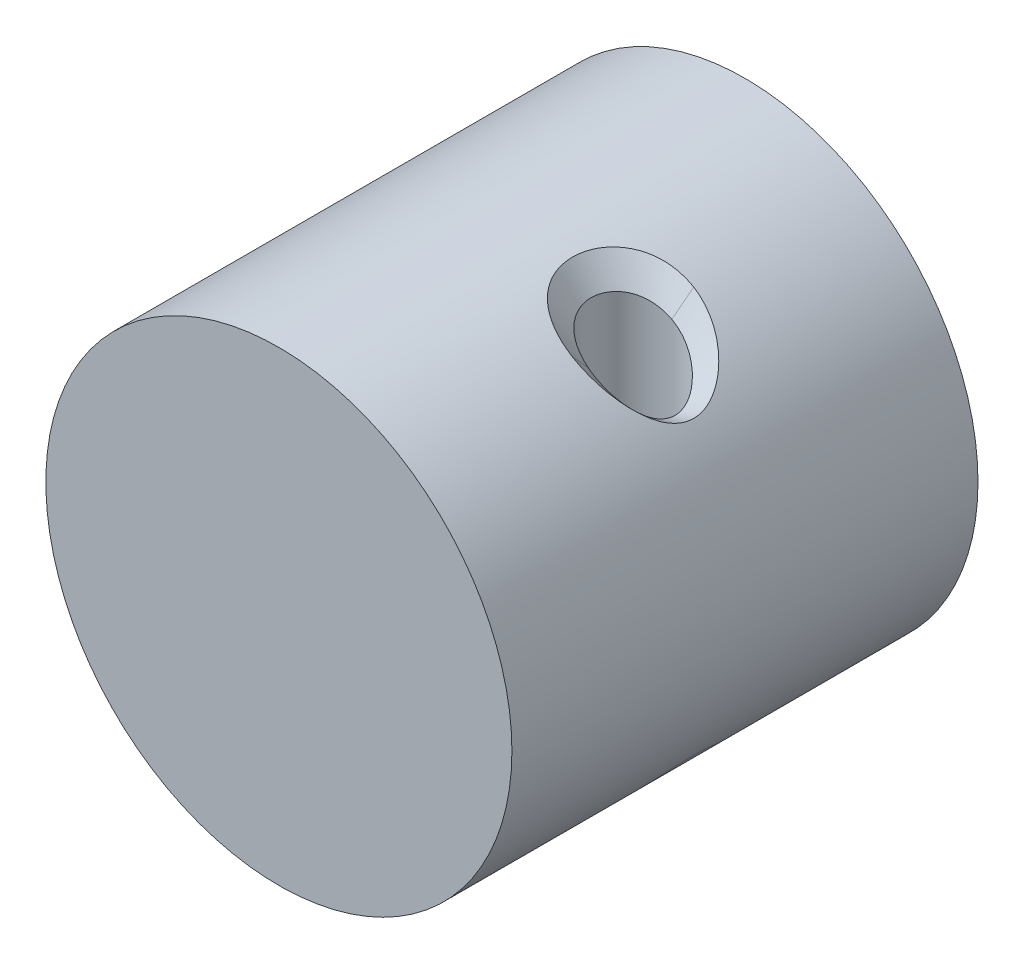
ISO-10303-21;
HEADER;
FILE_DESCRIPTION(('STEP AP214'),'2;1');
FILE_NAME('part.step','',(''),(''),'','','');
FILE_SCHEMA(('AUTOMOTIVE_DESIGN { 1 0 10303 214 1 1 1 1 }'));
ENDSEC;
DATA;
#1=APPLICATION_CONTEXT('core data for automotive mechanical design processes');
#2=APPLICATION_PROTOCOL_DEFINITION('international standard','automotive_design',2000,#1);
#3=PRODUCT_CONTEXT('',#1,'mechanical');
#4=PRODUCT('Part','Part','',(#3));
#5=PRODUCT_RELATED_PRODUCT_CATEGORY('part','',(#4));
#6=PRODUCT_DEFINITION_FORMATION('','',#4);
#7=PRODUCT_DEFINITION_CONTEXT('part definition',#1,'design');
#8=PRODUCT_DEFINITION('design','',#6,#7);
#9=PRODUCT_DEFINITION_SHAPE('','',#8);
#10=(LENGTH_UNIT() NAMED_UNIT(*) SI_UNIT(.MILLI.,.METRE.));
#11=(NAMED_UNIT(*) PLANE_ANGLE_UNIT() SI_UNIT($,.RADIAN.));
#12=(NAMED_UNIT(*) SI_UNIT($,.STERADIAN.) SOLID_ANGLE_UNIT());
#13=UNCERTAINTY_MEASURE_WITH_UNIT(LENGTH_MEASURE(1.E-05),#10,'distance_accuracy_value','');
#14=(GEOMETRIC_REPRESENTATION_CONTEXT(3) GLOBAL_UNCERTAINTY_ASSIGNED_CONTEXT((#13)) GLOBAL_UNIT_ASSIGNED_CONTEXT((#10,
#11,#12)) REPRESENTATION_CONTEXT('',''));
#15=CARTESIAN_POINT('',(0.,0.,0.));
#16=DIRECTION('',(0.,0.,1.));
#17=DIRECTION('',(1.,0.,0.));
#18=AXIS2_PLACEMENT_3D('',#15,#16,#17);
#19=CARTESIAN_POINT('',(13.,0.,0.));
#20=DIRECTION('',(0.,1.,0.));
#21=DIRECTION('',(0.,0.,1.));
#22=AXIS2_PLACEMENT_3D('',#19,#20,#21);
#23=PLANE('',#22);
#24=CARTESIAN_POINT('',(13.,0.,0.));
#25=DIRECTION('',(0.,1.,0.));
#26=DIRECTION('',(0.,0.,1.));
#27=AXIS2_PLACEMENT_3D('',#24,#25,#26);
#28=CIRCLE('',#27,4.5);
#29=CARTESIAN_POINT('',(13.,0.,4.5));
#30=VERTEX_POINT('',#29);
#31=EDGE_CURVE('E98',#30,#30,#28,.T.);
#32=ORIENTED_EDGE('',*,*,#31,.T.);
#33=EDGE_LOOP('',(#32));
#34=FACE_BOUND('',#33,.T.);
#35=ADVANCED_FACE('F52',(#34),#23,.T.);
#36=CARTESIAN_POINT('',(13.,50.,0.));
#37=DIRECTION('',(0.,-1.,0.));
#38=DIRECTION('',(0.,0.,-1.));
#39=AXIS2_PLACEMENT_3D('',#36,#37,#38);
#40=CYLINDRICAL_SURFACE('',#39,4.5);
#41=CARTESIAN_POINT('',(12.6674084370145,19.1973113609655,-4.48769237495518));
#42=CARTESIAN_POINT('',(12.8113358238304,19.1023404059298,-4.49835911200799));
#43=CARTESIAN_POINT('',(13.0991839004251,18.9072580588767,-4.5063241617474));
#44=CARTESIAN_POINT('',(13.6617635169946,18.5064168589458,-4.46930170712324));
#45=CARTESIAN_POINT('',(14.3381963674568,17.9894192372052,-4.32706851873552));
#46=CARTESIAN_POINT('',(15.0946728075174,17.3601425977765,-4.01362366231027));
#47=CARTESIAN_POINT('',(15.5995863116715,16.904254576384,-3.68627302350128));
#48=CARTESIAN_POINT('',(15.8562052480272,16.6608534851448,-3.47778969389754));
#49=CARTESIAN_POINT('',(16.0669317363568,16.4593012614342,-3.30043980984165));
#50=CARTESIAN_POINT('',(16.4309151331398,16.0993014532313,-2.94728824067339));
#51=CARTESIAN_POINT('',(16.7941973879742,15.7167870314836,-2.44692623098707));
#52=CARTESIAN_POINT('',(16.983813185499,15.5097994722607,-2.09470855603637));
#53=CARTESIAN_POINT('',(17.123160758998,15.3563859996964,-1.81591534970741));
#54=CARTESIAN_POINT('',(17.3307933039793,15.1232501912469,-1.30815995468614));
#55=CARTESIAN_POINT('',(17.477223749417,14.9519703822807,-0.613966273751012));
#56=CARTESIAN_POINT('',(17.4999849645947,14.9248291862753,-0.135857605967893));
#57=CARTESIAN_POINT('',(17.500022976544,14.9247846155879,0.206981820881932));
#58=CARTESIAN_POINT('',(17.4592368779605,14.9733619495722,0.756746770999842));
#59=CARTESIAN_POINT('',(17.2816077531659,15.1791715803523,1.44235796175824));
#60=CARTESIAN_POINT('',(17.0922270972506,15.3904574173731,1.87806944195416));
#61=CARTESIAN_POINT('',(16.9537228780467,15.5429112009438,2.15463406285004));
#62=CARTESIAN_POINT('',(16.7280344588034,15.7879222581436,2.55257721334004));
#63=CARTESIAN_POINT('',(16.3498136758131,16.1809825839583,3.03152755758218));
#64=CARTESIAN_POINT('',(16.0225696392356,16.5017467246879,3.33783889660257));
#65=CARTESIAN_POINT('',(15.8107191359716,16.7043491546741,3.51602766735527));
#66=CARTESIAN_POINT('',(15.5042812879849,16.9924013923794,3.75548494706409));
#67=CARTESIAN_POINT('',(14.9374670457241,17.4952333437093,4.09264580900104));
#68=CARTESIAN_POINT('',(14.1677401278714,18.124167034424,4.3761622224166));
#69=CARTESIAN_POINT('',(13.5126011806002,18.6153944955988,4.48654029876084));
#70=CARTESIAN_POINT('',(13.0071784220408,18.9699333893024,4.50463425543822));
#71=CARTESIAN_POINT('',(12.7799605964352,19.1230511116192,4.49605678743081));
#72=CARTESIAN_POINT('',(12.6665018748657,19.1979095282279,4.48762509580868));
#73=B_SPLINE_CURVE_WITH_KNOTS('',3,(#41,#42,#43,#44,#45,#46,#47,#48,#49,#50,#51,#52,#53,#54,#55,
#56,#57,#58,#59,#60,#61,#62,#63,#64,#65,#66,#67,#68,#69,#70,#71,#72),.UNSPECIFIED.,.F.,.F.,(4,1,
1,1,1,1,2,1,1,2,1,1,2,1,1,2,1,1,2,1,1,1,1,1,4),(0.,0.0296896401485679,0.0598626461155993,
0.119408406822819,0.178730743103001,0.238354257784476,0.25,0.297615050684946,0.357302345031847,
0.375,0.416881684684477,0.476580961989798,0.5,0.535897216868327,0.595460837860267,0.625,
0.655103409158899,0.71480391039653,0.75,0.773993967575648,0.833502102369901,0.892973295664285,
0.952561608972212,0.976448157278832,1.),.UNSPECIFIED.);
#74=CARTESIAN_POINT('',(12.6665018748657,19.1979095282279,4.48762509580868));
#75=VERTEX_POINT('',#74);
#76=CARTESIAN_POINT('',(12.6674084370145,19.1973113609655,-4.48769237495518));
#77=VERTEX_POINT('',#76);
#78=EDGE_CURVE('E83',#75,#77,#73,.F.);
#79=ORIENTED_EDGE('',*,*,#78,.T.);
#80=CARTESIAN_POINT('',(12.6665018748657,19.1979095282279,4.48762509580868));
#81=CARTESIAN_POINT('',(12.6131981718189,19.2330785373112,4.48366382795558));
#82=CARTESIAN_POINT('',(12.2962525293367,19.4400311675716,4.45414106820997));
#83=CARTESIAN_POINT('',(11.7100548373801,19.800423296512,4.33460743339638));
#84=CARTESIAN_POINT('',(10.929297934166,20.240439546616,4.02196270607052));
#85=CARTESIAN_POINT('',(10.2987709254565,20.5676177196548,3.62127118908255));
#86=CARTESIAN_POINT('',(9.94643954261468,20.7385496692951,3.31012668310573));
#87=CARTESIAN_POINT('',(9.73522102177483,20.8382957152601,3.09936476327365));
#88=CARTESIAN_POINT('',(9.44992829491727,20.971039185884,2.78853867659577));
#89=CARTESIAN_POINT('',(9.03379254638274,21.154996277946,2.17737056260884));
#90=CARTESIAN_POINT('',(8.66861197126774,21.306412533022,1.31304371530424));
#91=CARTESIAN_POINT('',(8.52036292590334,21.3640299297582,0.571486881982933));
#92=CARTESIAN_POINT('',(8.5002096437545,21.3716268931547,0.131182841398295));
#93=CARTESIAN_POINT('',(8.49968931844248,21.3718338381658,-0.185222961185701));
#94=CARTESIAN_POINT('',(8.5337917163399,21.3590359432492,-0.693415329155401));
#95=CARTESIAN_POINT('',(8.72856440729164,21.282297227023,-1.49352296497387));
#96=CARTESIAN_POINT('',(9.12647163947304,21.1151698407143,-2.33999326248839));
#97=CARTESIAN_POINT('',(9.5259431771974,20.9361898019072,-2.87841901789714));
#98=CARTESIAN_POINT('',(9.77214658269875,20.8208360763074,-3.13597650500143));
#99=CARTESIAN_POINT('',(9.98300709592635,20.7213611393454,-3.34747287516098));
#100=CARTESIAN_POINT('',(10.3874404596494,20.5236094464724,-3.69066277642946));
#101=CARTESIAN_POINT('',(11.0821410400566,20.15718564984,-4.09639697845266));
#102=CARTESIAN_POINT('',(11.7371438829625,19.7818319359338,-4.33173357381014));
#103=CARTESIAN_POINT('',(12.2693063408019,19.4555121724186,-4.44578865224781));
#104=CARTESIAN_POINT('',(12.5345292085128,19.2849921527481,-4.47784443828681));
#105=CARTESIAN_POINT('',(12.6674084370145,19.1973113609655,-4.48769237495518));
#106=B_SPLINE_CURVE_WITH_KNOTS('',3,(#80,#81,#82,#83,#84,#85,#86,#87,#88,#89,#90,#91,#92,#93,
#94,#95,#96,#97,#98,#99,#100,#101,#102,#103,#104,#105),.UNSPECIFIED.,.F.,.F.,(4,1,1,1,1,2,1,1,1,
1,2,1,1,1,1,2,1,1,1,1,4),(0.,0.0133885612293722,0.0793808651694622,0.145097142208488,
0.21099489500588,0.25,0.276916801100498,0.342555924877209,0.40842866580359,0.474326727089329,
0.5,0.539951206349501,0.605810998055243,0.671682046337782,0.737169997600315,0.75,
0.803015722914086,0.868407472297188,0.93423853821616,0.966832853205194,1.),.UNSPECIFIED.);
#107=EDGE_CURVE('E81',#77,#75,#106,.F.);
#108=ORIENTED_EDGE('',*,*,#107,.T.);
#109=EDGE_LOOP('',(#79,#108));
#110=FACE_BOUND('',#109,.T.);
#111=ORIENTED_EDGE('',*,*,#31,.F.);
#112=EDGE_LOOP('',(#111));
#113=FACE_BOUND('',#112,.T.);
#114=ADVANCED_FACE('F85',(#110,#113),#40,.F.);
#115=CARTESIAN_POINT('',(12.999002085176,21.3547639834673,6.50001883242266));
#116=CARTESIAN_POINT('',(12.6665018748657,19.1979095282279,4.48762509580868));
#117=CARTESIAN_POINT('',(12.9171721668449,21.4041696805128,6.49902418484315));
#118=CARTESIAN_POINT('',(12.6131981718189,19.2330785373112,4.48366382795558));
#119=CARTESIAN_POINT('',(12.4320020576317,21.6970963743211,6.49312691298189));
#120=CARTESIAN_POINT('',(12.2962525293367,19.4400311675716,4.45414106820997));
#121=CARTESIAN_POINT('',(11.5259498878056,22.1987006791078,6.37173345215423));
#122=CARTESIAN_POINT('',(11.7100548373801,19.800423296512,4.33460743339638));
#123=CARTESIAN_POINT('',(10.3028418143287,22.7910425642522,5.96241081864674));
#124=CARTESIAN_POINT('',(10.929297934166,20.240439546616,4.02196270607052));
#125=CARTESIAN_POINT('',(9.30461061900081,23.2102929060864,5.38424551430267));
#126=CARTESIAN_POINT('',(10.2987709254565,20.5676177196548,3.62127118908255));
#127=CARTESIAN_POINT('',(8.74822327686546,23.4203147467519,4.92382111997309));
#128=CARTESIAN_POINT('',(9.94643954261468,20.7385496692951,3.31012668310573));
#129=CARTESIAN_POINT('',(8.41583743083256,23.5413165469265,4.61188360408399));
#130=CARTESIAN_POINT('',(9.73522102177483,20.8382957152601,3.09936476327365));
#131=CARTESIAN_POINT('',(7.9658761288538,23.7005695983142,4.15201632126697));
#132=CARTESIAN_POINT('',(9.44992829491727,20.971039185884,2.78853867659577));
#133=CARTESIAN_POINT('',(7.30921595688821,23.9112641032729,3.24351165236692));
#134=CARTESIAN_POINT('',(9.03379254638274,21.154996277946,2.17737056260884));
#135=CARTESIAN_POINT('',(6.74537114955316,24.0740345154516,1.94883089304484));
#136=CARTESIAN_POINT('',(8.66861197126774,21.306412533022,1.31304371530424));
#137=CARTESIAN_POINT('',(6.52756424326578,24.1327498307024,0.837764370752551));
#138=CARTESIAN_POINT('',(8.52036292590334,21.3640299297582,0.571486881982933));
#139=CARTESIAN_POINT('',(6.4999997771481,24.1402389486494,0.182556287341253));
#140=CARTESIAN_POINT('',(8.5002096437545,21.3716268931547,0.131182841398295));
#141=CARTESIAN_POINT('',(6.50010830123597,24.1402282317526,-0.286995089134747));
#142=CARTESIAN_POINT('',(8.49968931844248,21.3718338381658,-0.185222961185701));
#143=CARTESIAN_POINT('',(6.55011993869301,24.1267176908903,-1.04407938032401));
#144=CARTESIAN_POINT('',(8.5337917163399,21.3590359432492,-0.693415329155401));
#145=CARTESIAN_POINT('',(6.84455973948589,24.0464575745716,-2.242065553867));
#146=CARTESIAN_POINT('',(8.72856440729164,21.282297227023,-1.49352296497387));
#147=CARTESIAN_POINT('',(7.4670173370514,23.8630727700917,-3.50522812547374));
#148=CARTESIAN_POINT('',(9.12647163947304,21.1151698407143,-2.33999326248839));
#149=CARTESIAN_POINT('',(8.10017976839173,23.6544606755916,-4.30084811682228));
#150=CARTESIAN_POINT('',(9.5259431771974,20.9361898019072,-2.87841901789714));
#151=CARTESIAN_POINT('',(8.48842637452462,23.5149059013199,-4.68010112659256));
#152=CARTESIAN_POINT('',(9.77214658269875,20.8208360763074,-3.13597650500143));
#153=CARTESIAN_POINT('',(8.82052377814038,23.3939562993395,-4.99149780326333));
#154=CARTESIAN_POINT('',(9.98300709592635,20.7213611393454,-3.34747287516098));
#155=CARTESIAN_POINT('',(9.45992284340521,23.1495655670542,-5.49603698984151));
#156=CARTESIAN_POINT('',(10.3874404596494,20.5236094464724,-3.69066277642946));
#157=CARTESIAN_POINT('',(10.555904086329,22.6753767552809,-6.06985924333391));
#158=CARTESIAN_POINT('',(11.0821410400566,20.15718564984,-4.09639697845266));
#159=CARTESIAN_POINT('',(11.5755396272118,22.1666440692279,-6.36429624873822));
#160=CARTESIAN_POINT('',(11.7371438829625,19.7818319359338,-4.33173357381014));
#161=CARTESIAN_POINT('',(12.3933762916966,21.7166280919984,-6.48374603856901));
#162=CARTESIAN_POINT('',(12.2693063408019,19.4555121724186,-4.44578865224781));
#163=CARTESIAN_POINT('',(12.7966212416046,21.4756799798169,-6.49455064078507));
#164=CARTESIAN_POINT('',(12.5345292085128,19.2849921527481,-4.47784443828681));
#165=CARTESIAN_POINT('',(13.,21.3541565040626,-6.5));
#166=CARTESIAN_POINT('',(12.6674084370145,19.1973113609655,-4.48769237495518));
#167=B_SPLINE_SURFACE_WITH_KNOTS('',3,1,((#115,#116),(#117,#118),(#119,#120),(#121,#122),(#123,
#124),(#125,#126),(#127,#128),(#129,#130),(#131,#132),(#133,#134),(#135,#136),(#137,#138),(#139,
#140),(#141,#142),(#143,#144),(#145,#146),(#147,#148),(#149,#150),(#151,#152),(#153,#154),(#155,
#156),(#157,#158),(#159,#160),(#161,#162),(#163,#164),(#165,#166)),.UNSPECIFIED.,.F.,.F.,.F.,(4,
1,1,1,1,2,1,1,1,1,2,1,1,1,1,2,1,1,1,1,4),(2,2),(0.,0.0133885612293722,0.0793808651694622,
0.145097142208488,0.21099489500588,0.25,0.276916801100498,0.342555924877209,0.40842866580359,
0.474326727089329,0.5,0.539951206349501,0.605810998055243,0.671682046337782,0.737169997600315,
0.75,0.803015722914086,0.868407472297188,0.93423853821616,0.966832853205194,1.),(0.,1.),.UNSPECIFIED.);
#168=CARTESIAN_POINT('',(13.,21.3541565040626,-6.5));
#169=CARTESIAN_POINT('',(12.7966212416046,21.4756799798169,-6.49455064078507));
#170=CARTESIAN_POINT('',(12.3933762916966,21.7166280919984,-6.48374603856901));
#171=CARTESIAN_POINT('',(11.5755396272118,22.1666440692279,-6.36429624873822));
#172=CARTESIAN_POINT('',(10.555904086329,22.6753767552809,-6.06985924333391));
#173=CARTESIAN_POINT('',(9.45992284340521,23.1495655670542,-5.49603698984151));
#174=CARTESIAN_POINT('',(8.82052377814038,23.3939562993395,-4.99149780326333));
#175=CARTESIAN_POINT('',(8.48842637452462,23.5149059013199,-4.68010112659256));
#176=CARTESIAN_POINT('',(8.10017976839173,23.6544606755916,-4.30084811682228));
#177=CARTESIAN_POINT('',(7.4670173370514,23.8630727700917,-3.50522812547374));
#178=CARTESIAN_POINT('',(6.84455973948589,24.0464575745716,-2.242065553867));
#179=CARTESIAN_POINT('',(6.55011993869301,24.1267176908903,-1.04407938032401));
#180=CARTESIAN_POINT('',(6.50010830123597,24.1402282317526,-0.286995089134747));
#181=CARTESIAN_POINT('',(6.4999997771481,24.1402389486494,0.182556287341253));
#182=CARTESIAN_POINT('',(6.52756424326578,24.1327498307024,0.837764370752551));
#183=CARTESIAN_POINT('',(6.74537114955316,24.0740345154516,1.94883089304484));
#184=CARTESIAN_POINT('',(7.30921595688821,23.9112641032729,3.24351165236692));
#185=CARTESIAN_POINT('',(7.9658761288538,23.7005695983142,4.15201632126697));
#186=CARTESIAN_POINT('',(8.41583743083256,23.5413165469265,4.61188360408399));
#187=CARTESIAN_POINT('',(8.74822327686546,23.4203147467519,4.92382111997309));
#188=CARTESIAN_POINT('',(9.30461061900081,23.2102929060864,5.38424551430267));
#189=CARTESIAN_POINT('',(10.3028418143287,22.7910425642522,5.96241081864674));
#190=CARTESIAN_POINT('',(11.5259498878056,22.1987006791078,6.37173345215423));
#191=CARTESIAN_POINT('',(12.4320020576317,21.6970963743211,6.49312691298189));
#192=CARTESIAN_POINT('',(12.9171721668449,21.4041696805128,6.49902418484315));
#193=CARTESIAN_POINT('',(12.999002085176,21.3547639834673,6.50001883242266));
#194=B_SPLINE_CURVE_WITH_KNOTS('',3,(#168,#169,#170,#171,#172,#173,#174,#175,#176,#177,#178,
#179,#180,#181,#182,#183,#184,#185,#186,#187,#188,#189,#190,#191,#192,#193),.UNSPECIFIED.,.F.,
.F.,(4,1,1,1,1,2,1,1,1,1,2,1,1,1,1,2,1,1,1,1,4),(0.,0.0331671467948065,0.0657614617838401,
0.131592527702812,0.196984277085914,0.25,0.262830002399685,0.328317953662218,0.394189001944757,
0.460048793650499,0.5,0.525673272910671,0.59157133419641,0.657444075122791,0.723083198899502,
0.75,0.78900510499412,0.854902857791512,0.920619134830538,0.986611438770628,1.),.UNSPECIFIED.);
#195=CARTESIAN_POINT('',(13.,21.3541565040626,-6.5));
#196=VERTEX_POINT('',#195);
#197=CARTESIAN_POINT('',(12.999002085176,21.3547639834673,6.50001883242266));
#198=VERTEX_POINT('',#197);
#199=EDGE_CURVE('E71',#196,#198,#194,.T.);
#200=DIRECTION('',(-0.112007508709105,-0.726567643232607,-0.677903959127098));
#201=VECTOR('',#200,1.);
#202=CARTESIAN_POINT('',(12.8327519800208,20.2763367558476,5.49382196411568));
#203=LINE('',#202,#201);
#204=EDGE_CURVE('E91',#198,#75,#203,.T.);
#205=DIRECTION('',(0.112040354500132,0.726577945228933,-0.677887489536712));
#206=VECTOR('',#205,1.);
#207=CARTESIAN_POINT('',(12.8337042185072,20.2757339325141,-5.49384618747759));
#208=LINE('',#207,#206);
#209=EDGE_CURVE('E92',#77,#196,#208,.T.);
#210=ORIENTED_EDGE('',*,*,#199,.T.);
#211=ORIENTED_EDGE('',*,*,#204,.T.);
#212=ORIENTED_EDGE('',*,*,#107,.F.);
#213=ORIENTED_EDGE('',*,*,#209,.T.);
#214=EDGE_LOOP('',(#210,#211,#212,#213));
#215=FACE_BOUND('',#214,.T.);
#216=ADVANCED_FACE('F96',(#215),#167,.F.);
#217=CARTESIAN_POINT('',(13.,21.3541565040626,-6.5));
#218=CARTESIAN_POINT('',(12.6674084370145,19.1973113609655,-4.48769237495518));
#219=CARTESIAN_POINT('',(13.1992790013318,21.2305933588053,-6.49465375152879));
#220=CARTESIAN_POINT('',(12.8113358238304,19.1023404059298,-4.49835911200799));
#221=CARTESIAN_POINT('',(13.6010813901552,20.9814553833885,-6.48387421433412));
#222=CARTESIAN_POINT('',(13.0991839004251,18.9072580588767,-4.5063241617474));
#223=CARTESIAN_POINT('',(14.3796155177113,20.4593525698118,-6.37149499309609));
#224=CARTESIAN_POINT('',(13.6617635169946,18.5064168589458,-4.46930170712324));
#225=CARTESIAN_POINT('',(15.3097802638075,19.7795511977209,-6.11196278116478));
#226=CARTESIAN_POINT('',(14.3381963674568,17.9894192372052,-4.32706851873552));
#227=CARTESIAN_POINT('',(16.3345700156585,18.9402665889614,-5.61749651581658));
#228=CARTESIAN_POINT('',(15.0946728075174,17.3601425977765,-4.01362366231027));
#229=CARTESIAN_POINT('',(17.0107158271626,18.3256995584929,-5.13264296648664));
#230=CARTESIAN_POINT('',(15.5995863116715,16.904254576384,-3.68627302350128));
#231=CARTESIAN_POINT('',(17.3523956256727,17.9972272775758,-4.828299974974));
#232=CARTESIAN_POINT('',(15.8562052480272,16.6608534851448,-3.47778969389754));
#233=CARTESIAN_POINT('',(17.6326695117756,17.7253141227659,-4.56979707030042));
#234=CARTESIAN_POINT('',(16.0669317363568,16.4593012614342,-3.30043980984165));
#235=CARTESIAN_POINT('',(18.1117660548251,17.2419495095163,-4.06145781800549));
#236=CARTESIAN_POINT('',(16.4309151331398,16.0993014532313,-2.94728824067339));
#237=CARTESIAN_POINT('',(18.5856061148733,16.7241260731791,-3.36032049766761));
#238=CARTESIAN_POINT('',(16.7941973879742,15.7167870314836,-2.44692623098707));
#239=CARTESIAN_POINT('',(18.8313698454318,16.4434010347376,-2.87425670746));
#240=CARTESIAN_POINT('',(16.983813185499,15.5097994722607,-2.09470855603637));
#241=CARTESIAN_POINT('',(19.01126133873,16.2359827890433,-2.49096236630277));
#242=CARTESIAN_POINT('',(17.123160758998,15.3563859996964,-1.81591534970741));
#243=CARTESIAN_POINT('',(19.2803496335029,15.9175020223257,-1.80086273891094));
#244=CARTESIAN_POINT('',(17.3307933039793,15.1232501912469,-1.30815995468614));
#245=CARTESIAN_POINT('',(19.4722231939147,15.6789280181968,-0.844922754333107));
#246=CARTESIAN_POINT('',(17.477223749417,14.9519703822807,-0.613966273751012));
#247=CARTESIAN_POINT('',(19.4996547352324,15.6450599487486,-0.18547678789009));
#248=CARTESIAN_POINT('',(17.4999849645947,14.9248291862753,-0.135857605967893));
#249=CARTESIAN_POINT('',(19.4994000653617,15.6454645978393,0.285264124330699));
#250=CARTESIAN_POINT('',(17.500022976544,14.9247846155879,0.206981820881932));
#251=CARTESIAN_POINT('',(19.4500705059274,15.7067365992941,1.04318894027679));
#252=CARTESIAN_POINT('',(17.4592368779605,14.9733619495722,0.756746770999842));
#253=CARTESIAN_POINT('',(19.2191758370433,15.991296590182,1.9756067310797));
#254=CARTESIAN_POINT('',(17.2816077531659,15.1791715803523,1.44235796175824));
#255=CARTESIAN_POINT('',(18.9735748602009,16.2794520310086,2.57134110419737));
#256=CARTESIAN_POINT('',(17.0922270972506,15.3904574173731,1.87806944195416));
#257=CARTESIAN_POINT('',(18.7935507709909,16.4869726036245,2.95490645656287));
#258=CARTESIAN_POINT('',(16.9537228780467,15.5429112009438,2.15463406285004));
#259=CARTESIAN_POINT('',(18.4985097865872,16.8218988477916,3.50911708822982));
#260=CARTESIAN_POINT('',(16.7280344588034,15.7879222581436,2.55257721334004));
#261=CARTESIAN_POINT('',(18.0035350212498,17.3534817322114,4.18428263933512));
#262=CARTESIAN_POINT('',(16.3498136758131,16.1809825839583,3.03152755758218));
#263=CARTESIAN_POINT('',(17.5733062426627,17.7829167536281,4.62458553839832));
#264=CARTESIAN_POINT('',(16.0225696392356,16.5017467246879,3.33783889660257));
#265=CARTESIAN_POINT('',(17.2933639921247,18.0544791646627,4.88275905719596));
#266=CARTESIAN_POINT('',(15.8107191359716,16.7043491546741,3.51602766735527));
#267=CARTESIAN_POINT('',(16.8872856742177,18.4411526091785,5.23114831744185));
#268=CARTESIAN_POINT('',(15.5042812879849,16.9924013923794,3.75548494706409));
#269=CARTESIAN_POINT('',(16.1294667610176,19.1155920627508,5.73436558583765));
#270=CARTESIAN_POINT('',(14.9374670457241,17.4952333437093,4.09264580900104));
#271=CARTESIAN_POINT('',(15.0847915161424,19.9519410243129,6.19263095188708));
#272=CARTESIAN_POINT('',(14.1677401278714,18.124167034424,4.3761622224166));
#273=CARTESIAN_POINT('',(14.1794602441239,20.5977016845316,6.409700228549));
#274=CARTESIAN_POINT('',(13.5126011806002,18.6153944955988,4.48654029876084));
#275=CARTESIAN_POINT('',(13.4759561627709,21.0601738337326,6.48993849056815));
#276=CARTESIAN_POINT('',(13.0071784220408,18.9699333893024,4.50463425543822));
#277=CARTESIAN_POINT('',(13.1572371948174,21.2570302459183,6.49667456077577));
#278=CARTESIAN_POINT('',(12.7799605964352,19.1230511116192,4.49605678743081));
#279=CARTESIAN_POINT('',(12.999002085176,21.3547639834673,6.50001883242267));
#280=CARTESIAN_POINT('',(12.6665018748657,19.1979095282279,4.48762509580868));
#281=B_SPLINE_SURFACE_WITH_KNOTS('',3,1,((#217,#218),(#219,#220),(#221,#222),(#223,#224),(#225,
#226),(#227,#228),(#229,#230),(#231,#232),(#233,#234),(#235,#236),(#237,#238),(#239,#240),(#241,
#242),(#243,#244),(#245,#246),(#247,#248),(#249,#250),(#251,#252),(#253,#254),(#255,#256),(#257,
#258),(#259,#260),(#261,#262),(#263,#264),(#265,#266),(#267,#268),(#269,#270),(#271,#272),(#273,
#274),(#275,#276),(#277,#278),(#279,#280)),.UNSPECIFIED.,.F.,.F.,.F.,(4,1,1,1,1,1,2,1,1,2,1,1,2,
1,1,2,1,1,2,1,1,1,1,1,4),(2,2),(0.,0.0296896401485679,0.0598626461155993,0.119408406822819,
0.178730743103001,0.238354257784476,0.25,0.297615050684946,0.357302345031847,0.375,
0.416881684684477,0.476580961989798,0.5,0.535897216868327,0.595460837860267,0.625,
0.655103409158899,0.71480391039653,0.75,0.773993967575648,0.833502102369901,0.892973295664285,
0.952561608972212,0.976448157278832,1.),(0.,1.),.UNSPECIFIED.);
#282=CARTESIAN_POINT('',(12.999002085176,21.3547639834673,6.50001883242267));
#283=CARTESIAN_POINT('',(13.1572371948174,21.2570302459183,6.49667456077577));
#284=CARTESIAN_POINT('',(13.4759561627709,21.0601738337326,6.48993849056815));
#285=CARTESIAN_POINT('',(14.1794602441239,20.5977016845316,6.409700228549));
#286=CARTESIAN_POINT('',(15.0847915161424,19.9519410243129,6.19263095188708));
#287=CARTESIAN_POINT('',(16.1294667610176,19.1155920627508,5.73436558583765));
#288=CARTESIAN_POINT('',(16.8872856742177,18.4411526091785,5.23114831744185));
#289=CARTESIAN_POINT('',(17.2933639921247,18.0544791646627,4.88275905719596));
#290=CARTESIAN_POINT('',(17.5733062426627,17.7829167536281,4.62458553839832));
#291=CARTESIAN_POINT('',(18.0035350212498,17.3534817322114,4.18428263933512));
#292=CARTESIAN_POINT('',(18.4985097865872,16.8218988477916,3.50911708822982));
#293=CARTESIAN_POINT('',(18.7935507709909,16.4869726036245,2.95490645656287));
#294=CARTESIAN_POINT('',(18.9735748602009,16.2794520310086,2.57134110419737));
#295=CARTESIAN_POINT('',(19.2191758370433,15.991296590182,1.9756067310797));
#296=CARTESIAN_POINT('',(19.4500705059274,15.7067365992941,1.04318894027679));
#297=CARTESIAN_POINT('',(19.4994000653617,15.6454645978393,0.285264124330699));
#298=CARTESIAN_POINT('',(19.4996547352324,15.6450599487486,-0.18547678789009));
#299=CARTESIAN_POINT('',(19.4722231939147,15.6789280181968,-0.844922754333107));
#300=CARTESIAN_POINT('',(19.2803496335029,15.9175020223257,-1.80086273891094));
#301=CARTESIAN_POINT('',(19.01126133873,16.2359827890433,-2.49096236630277));
#302=CARTESIAN_POINT('',(18.8313698454318,16.4434010347376,-2.87425670746));
#303=CARTESIAN_POINT('',(18.5856061148733,16.7241260731791,-3.36032049766761));
#304=CARTESIAN_POINT('',(18.1117660548251,17.2419495095163,-4.06145781800549));
#305=CARTESIAN_POINT('',(17.6326695117756,17.7253141227659,-4.56979707030042));
#306=CARTESIAN_POINT('',(17.3523956256727,17.9972272775758,-4.828299974974));
#307=CARTESIAN_POINT('',(17.0107158271626,18.3256995584929,-5.13264296648664));
#308=CARTESIAN_POINT('',(16.3345700156585,18.9402665889614,-5.61749651581658));
#309=CARTESIAN_POINT('',(15.3097802638075,19.7795511977209,-6.11196278116478));
#310=CARTESIAN_POINT('',(14.3796155177113,20.4593525698118,-6.37149499309609));
#311=CARTESIAN_POINT('',(13.6010813901552,20.9814553833885,-6.48387421433412));
#312=CARTESIAN_POINT('',(13.1992790013318,21.2305933588053,-6.49465375152879));
#313=CARTESIAN_POINT('',(13.,21.3541565040626,-6.5));
#314=B_SPLINE_CURVE_WITH_KNOTS('',3,(#282,#283,#284,#285,#286,#287,#288,#289,#290,#291,#292,
#293,#294,#295,#296,#297,#298,#299,#300,#301,#302,#303,#304,#305,#306,#307,#308,#309,#310,#311,
#312,#313),.UNSPECIFIED.,.F.,.F.,(4,1,1,1,1,1,2,1,1,2,1,1,2,1,1,2,1,1,2,1,1,1,1,1,4),(0.,
0.0235518427211676,0.0474383910277878,0.107026704335715,0.166497897630099,0.226006032424352,
0.25,0.28519608960347,0.344896590841101,0.375,0.404539162139733,0.464102783131673,0.5,
0.523419038010202,0.583118315315523,0.625,0.642697654968153,0.702384949315054,0.75,
0.761645742215524,0.821269256896999,0.880591593177181,0.940137353884401,0.970310359851432,1.),.UNSPECIFIED.);
#315=EDGE_CURVE('E62',#198,#196,#314,.T.);
#316=ORIENTED_EDGE('',*,*,#315,.T.);
#317=ORIENTED_EDGE('',*,*,#209,.F.);
#318=ORIENTED_EDGE('',*,*,#78,.F.);
#319=ORIENTED_EDGE('',*,*,#204,.F.);
#320=EDGE_LOOP('',(#316,#317,#318,#319));
#321=FACE_BOUND('',#320,.T.);
#322=ADVANCED_FACE('F100',(#321),#281,.F.);
#323=CARTESIAN_POINT('',(0.,0.,25.));
#324=DIRECTION('',(0.,0.,-1.));
#325=DIRECTION('',(-1.,0.,0.));
#326=AXIS2_PLACEMENT_3D('',#323,#324,#325);
#327=CYLINDRICAL_SURFACE('',#326,25.);
#328=CARTESIAN_POINT('',(13.,-21.3541565040626,-6.5));
#329=CARTESIAN_POINT('',(13.0991065003664,-21.2938243507708,-6.5000040935284));
#330=CARTESIAN_POINT('',(13.1977879029238,-21.232801484001,-6.49774828449632));
#331=CARTESIAN_POINT('',(13.3948042121914,-21.1090695763485,-6.4887878503398));
#332=CARTESIAN_POINT('',(13.4931324243456,-21.0463520070919,-6.48205367003937));
#333=CARTESIAN_POINT('',(13.6894089106053,-20.9192225458876,-6.46413798506059));
#334=CARTESIAN_POINT('',(13.7873477267121,-20.8548010692973,-6.45292105488845));
#335=CARTESIAN_POINT('',(13.9828157841583,-20.7242563966996,-6.42604637812811));
#336=CARTESIAN_POINT('',(14.0803325300578,-20.6581228986514,-6.4103478948509));
#337=CARTESIAN_POINT('',(14.2715112498532,-20.526497563586,-6.37514530761036));
#338=CARTESIAN_POINT('',(14.3652090162786,-20.461030022854,-6.35574442676144));
#339=CARTESIAN_POINT('',(14.551515542733,-20.3289569965468,-6.31288037065299));
#340=CARTESIAN_POINT('',(14.6441174760614,-20.2623477077814,-6.28939925005405));
#341=CARTESIAN_POINT('',(14.8282224943009,-20.1280122447243,-6.2383791431412));
#342=CARTESIAN_POINT('',(14.9197163100986,-20.0602818688121,-6.21081779510063));
#343=CARTESIAN_POINT('',(15.1015960152262,-19.9237250198674,-6.15164084651389));
#344=CARTESIAN_POINT('',(15.1919700378876,-19.8548942177731,-6.11999879210978));
#345=CARTESIAN_POINT('',(15.3706446672693,-19.7168960182733,-6.05302659468933));
#346=CARTESIAN_POINT('',(15.4589503197845,-19.6477300794814,-6.01770690030551));
#347=CARTESIAN_POINT('',(15.6337052509512,-19.5089650001979,-5.94333072716571));
#348=CARTESIAN_POINT('',(15.7201535924676,-19.4393656628584,-5.90427241384483));
#349=CARTESIAN_POINT('',(15.8912100650798,-19.2997836275117,-5.82242254818172));
#350=CARTESIAN_POINT('',(15.9758150264575,-19.2298004939928,-5.77962511570326));
#351=CARTESIAN_POINT('',(16.1432018520203,-19.0894995368113,-5.69030050166403));
#352=CARTESIAN_POINT('',(16.2259781743109,-19.0191813197147,-5.64376355753604));
#353=CARTESIAN_POINT('',(16.3892527845837,-18.8786643915012,-5.54724709204718));
#354=CARTESIAN_POINT('',(16.4697553451635,-18.8084657266493,-5.49727473089063));
#355=CARTESIAN_POINT('',(16.6281441087102,-18.6685812763863,-5.39407930458088));
#356=CARTESIAN_POINT('',(16.7060421617426,-18.5988947782616,-5.34087540090002));
#357=CARTESIAN_POINT('',(16.859268864816,-18.4601108195034,-5.23122028616534));
#358=CARTESIAN_POINT('',(16.9346072247664,-18.3910121152647,-5.1747842214447));
#359=CARTESIAN_POINT('',(17.0827617820378,-18.253477319784,-5.05866849557164));
#360=CARTESIAN_POINT('',(17.1555853550356,-18.1850398076024,-4.99899992678556));
#361=CARTESIAN_POINT('',(17.3011940141336,-18.0465812611234,-4.87434258463741));
#362=CARTESIAN_POINT('',(17.3739039997388,-17.9765792166833,-4.80924489163312));
#363=CARTESIAN_POINT('',(17.5158042404787,-17.8383375163651,-4.67627966868507));
#364=CARTESIAN_POINT('',(17.5850281182669,-17.7700867858919,-4.60845957270159));
#365=CARTESIAN_POINT('',(17.7200401311087,-17.6354517246345,-4.47005312898225));
#366=CARTESIAN_POINT('',(17.7858593775535,-17.5690548447909,-4.39950937436849));
#367=CARTESIAN_POINT('',(17.9141447980695,-17.4382258663769,-4.25566129873148));
#368=CARTESIAN_POINT('',(17.9766391991059,-17.3737803788327,-4.1823943399573));
#369=CARTESIAN_POINT('',(18.1016531242031,-17.2435106507837,-4.02906367174767));
#370=CARTESIAN_POINT('',(18.1640494647202,-17.1777531045091,-3.94884256728187));
#371=CARTESIAN_POINT('',(18.2844139878511,-17.0495680794234,-3.78626304279279));
#372=CARTESIAN_POINT('',(18.3424479370877,-16.9870995776631,-3.70398578090694));
#373=CARTESIAN_POINT('',(18.4542054922338,-16.8656152189975,-3.53729979902593));
#374=CARTESIAN_POINT('',(18.5079914520935,-16.8065556067307,-3.45296490047472));
#375=CARTESIAN_POINT('',(18.611365871886,-16.692001283834,-3.2821729991658));
#376=CARTESIAN_POINT('',(18.6610124101968,-16.6364615720959,-3.19578140490315));
#377=CARTESIAN_POINT('',(18.7605728356983,-16.5241323061377,-3.01287753883694));
#378=CARTESIAN_POINT('',(18.8102295102664,-16.4675594545479,-2.91609138433404));
#379=CARTESIAN_POINT('',(18.9040800590985,-16.359728850743,-2.72103696062071));
#380=CARTESIAN_POINT('',(18.9483853075677,-16.3083687688283,-2.62287945467567));
#381=CARTESIAN_POINT('',(19.0112212858223,-16.2349769994937,-2.4736691035687));
#382=CARTESIAN_POINT('',(19.0313862823124,-16.2113310811309,-2.42408798651378));
#383=CARTESIAN_POINT('',(19.0704156500786,-16.1653996005963,-2.3245753700951));
#384=CARTESIAN_POINT('',(19.0892923550478,-16.1431014792402,-2.27465453463875));
#385=CARTESIAN_POINT('',(19.125759546754,-16.0998792798656,-2.17446512919143));
#386=CARTESIAN_POINT('',(19.1433616720897,-16.0789430146264,-2.12420605533899));
#387=CARTESIAN_POINT('',(19.1772947946242,-16.0384555105974,-2.02334152440601));
#388=CARTESIAN_POINT('',(19.1936366255801,-16.0188926385473,-1.97274438578671));
#389=CARTESIAN_POINT('',(19.2264902933574,-15.9794487491287,-1.8665869948892));
#390=CARTESIAN_POINT('',(19.2429072828575,-15.9596719242976,-1.81095853361683));
#391=CARTESIAN_POINT('',(19.2741656176606,-15.9219073226147,-1.69953198621939));
#392=CARTESIAN_POINT('',(19.2890248333965,-15.9038994512007,-1.6437457352059));
#393=CARTESIAN_POINT('',(19.3171844566309,-15.8696839841654,-1.53200557699238));
#394=CARTESIAN_POINT('',(19.3305013735071,-15.8534574427745,-1.47606164413039));
#395=CARTESIAN_POINT('',(19.3555913455747,-15.8228149101037,-1.36400800139044));
#396=CARTESIAN_POINT('',(19.3673793545534,-15.8083814512323,-1.30790642616224));
#397=CARTESIAN_POINT('',(19.3894253234541,-15.781333507529,-1.19553936917749));
#398=CARTESIAN_POINT('',(19.3996964800884,-15.7687033702014,-1.13928025182577));
#399=CARTESIAN_POINT('',(19.4187212281245,-15.7452688745599,-1.02659991800875));
#400=CARTESIAN_POINT('',(19.4274860692241,-15.7344509984854,-0.970183417562132));
#401=CARTESIAN_POINT('',(19.4435092669872,-15.7146463109409,-0.85718989385211));
#402=CARTESIAN_POINT('',(19.4507767536253,-15.7056484089079,-0.800616112944049));
#403=CARTESIAN_POINT('',(19.4638152590642,-15.6894870182233,-0.687309775937096));
#404=CARTESIAN_POINT('',(19.4695931377633,-15.6823151224738,-0.63057920953388));
#405=CARTESIAN_POINT('',(19.4798292877223,-15.6695985796659,-0.515048005225102));
#406=CARTESIAN_POINT('',(19.4842418469246,-15.6641103454464,-0.456237078040793));
#407=CARTESIAN_POINT('',(19.4914561224778,-15.6551324263412,-0.338629312124846));
#408=CARTESIAN_POINT('',(19.4942649474095,-15.6516339222147,-0.279833584302175));
#409=CARTESIAN_POINT('',(19.4982780755746,-15.6466342183815,-0.162257218428014));
#410=CARTESIAN_POINT('',(19.4994865738611,-15.6451277966978,-0.103476946374102));
#411=CARTESIAN_POINT('',(19.5003033131918,-15.6441097901422,0.0140678017225282));
#412=CARTESIAN_POINT('',(19.4999127581822,-15.6445967044637,0.0728322563471731));
#413=CARTESIAN_POINT('',(19.4975339886353,-15.6475612145597,0.190345096351634));
#414=CARTESIAN_POINT('',(19.4955439643463,-15.6500410652818,0.249093388079914));
#415=CARTESIAN_POINT('',(19.489966971859,-15.6569858942201,0.366574052478343));
#416=CARTESIAN_POINT('',(19.4863752154034,-15.6614568245635,0.425305845086545));
#417=CARTESIAN_POINT('',(19.4775937256667,-15.6723767161954,0.542754054326496));
#418=CARTESIAN_POINT('',(19.4723963171036,-15.6788351776252,0.601469011277569));
#419=CARTESIAN_POINT('',(19.4604000901418,-15.6937223195722,0.718884572283594));
#420=CARTESIAN_POINT('',(19.4535908482479,-15.7021638213094,0.777582482312803));
#421=CARTESIAN_POINT('',(19.4387487050476,-15.7205337766771,0.892024240420271));
#422=CARTESIAN_POINT('',(19.4307790907762,-15.7303850320303,0.947788745834417));
#423=CARTESIAN_POINT('',(19.4133989016206,-15.7518295676765,1.05913094307115));
#424=CARTESIAN_POINT('',(19.4039795006243,-15.7634335094229,1.11470520182193));
#425=CARTESIAN_POINT('',(19.3836920218405,-15.7883736952342,1.22566778557481));
#426=CARTESIAN_POINT('',(19.3728131798879,-15.8017227900362,1.28105124872122));
#427=CARTESIAN_POINT('',(19.3495979264051,-15.8301421272012,1.39163380033815));
#428=CARTESIAN_POINT('',(19.3372489729047,-15.8452271365823,1.44682645395248));
#429=CARTESIAN_POINT('',(19.3110829462021,-15.8771063197699,1.55702895278396));
#430=CARTESIAN_POINT('',(19.2972517242551,-15.8939168860574,1.61203068768387));
#431=CARTESIAN_POINT('',(19.2681090449585,-15.9292342591532,1.72185302216611));
#432=CARTESIAN_POINT('',(19.2527820116623,-15.9477587803465,1.77666378093739));
#433=CARTESIAN_POINT('',(19.2206341598655,-15.9864900474641,1.88610594532809));
#434=CARTESIAN_POINT('',(19.2037965212149,-16.0067155220316,1.94072576920809));
#435=CARTESIAN_POINT('',(19.1686119047227,-16.0488342585664,2.04978756439596));
#436=CARTESIAN_POINT('',(19.1502470341843,-16.0707469712874,2.1042162377976));
#437=CARTESIAN_POINT('',(19.1137771119511,-16.1141013514713,2.20782867766221));
#438=CARTESIAN_POINT('',(19.095766046868,-16.1354435907254,2.25708723299172));
#439=CARTESIAN_POINT('',(19.0585407796501,-16.1793961996477,2.35523999757607));
#440=CARTESIAN_POINT('',(19.0393162770684,-16.2020171864199,2.40412552460753));
#441=CARTESIAN_POINT('',(18.9794786869268,-16.272160450661,2.55106608159923));
#442=CARTESIAN_POINT('',(18.9372897540544,-16.321262023936,2.64773581962479));
#443=CARTESIAN_POINT('',(18.8479738102763,-16.4243309642296,2.83966319500754));
#444=CARTESIAN_POINT('',(18.8007506644211,-16.4783884774235,2.93482718531156));
#445=CARTESIAN_POINT('',(18.7012368676351,-16.5912491839388,3.12376754634547));
#446=CARTESIAN_POINT('',(18.6488436522038,-16.6501412241674,3.2174366414946));
#447=CARTESIAN_POINT('',(18.5440981135333,-16.7666975300941,3.39453023173741));
#448=CARTESIAN_POINT('',(18.4919831425386,-16.8241750089325,3.47821897800196));
#449=CARTESIAN_POINT('',(18.3838407736005,-16.942281901195,3.64348106873198));
#450=CARTESIAN_POINT('',(18.3277619391019,-17.002948278974,3.72499429654385));
#451=CARTESIAN_POINT('',(18.2115926202413,-17.1273252456489,3.88591133027562));
#452=CARTESIAN_POINT('',(18.1514468746285,-17.1910714873569,3.96524757874433));
#453=CARTESIAN_POINT('',(18.0270386262241,-17.3214941956204,4.12181870782451));
#454=CARTESIAN_POINT('',(17.9627177422471,-17.3882037911851,4.19897950390819));
#455=CARTESIAN_POINT('',(17.8337178305758,-17.5204657984332,4.34677174649007));
#456=CARTESIAN_POINT('',(17.769142919421,-17.5859676197654,4.41753956969859));
#457=CARTESIAN_POINT('',(17.6368454301535,-17.7186494963302,4.5562775939128));
#458=CARTESIAN_POINT('',(17.5690992005019,-17.7858394852017,4.62421573376878));
#459=CARTESIAN_POINT('',(17.4303884482309,-17.9218048695971,4.75729902018917));
#460=CARTESIAN_POINT('',(17.3593975313286,-17.9905895110177,4.82240718239913));
#461=CARTESIAN_POINT('',(17.2141252800649,-18.1296475004482,4.9498362568212));
#462=CARTESIAN_POINT('',(17.1398151355552,-18.1999288481291,5.01211556553101));
#463=CARTESIAN_POINT('',(16.9906144025534,-18.3392800324123,5.13165697895062));
#464=CARTESIAN_POINT('',(16.9157808176815,-18.4083383221724,5.1890037554277));
#465=CARTESIAN_POINT('',(16.7637287452745,-18.5469134783164,5.3003652256482));
#466=CARTESIAN_POINT('',(16.686505759135,-18.6164309880687,5.35437297776272));
#467=CARTESIAN_POINT('',(16.5296379981321,-18.7558554552938,5.45906077145419));
#468=CARTESIAN_POINT('',(16.449986403559,-18.8257629507748,5.50972987564494));
#469=CARTESIAN_POINT('',(16.2882246820332,-18.965896646476,5.60774497319198));
#470=CARTESIAN_POINT('',(16.2061055934466,-19.036122945915,5.65507602998505));
#471=CARTESIAN_POINT('',(16.039554796154,-19.1766679251833,5.74631539049775));
#472=CARTESIAN_POINT('',(15.9551167446954,-19.2469862235569,5.79021270540357));
#473=CARTESIAN_POINT('',(15.7845350847303,-19.3871243771985,5.87417404687402));
#474=CARTESIAN_POINT('',(15.6983987384024,-19.4569451154319,5.91425134669196));
#475=CARTESIAN_POINT('',(15.5244135406138,-19.5960444432206,5.99057697336758));
#476=CARTESIAN_POINT('',(15.4365695412697,-19.6653239546776,6.02683467715943));
#477=CARTESIAN_POINT('',(15.2591627413563,-19.8032967415042,6.09552564311886));
#478=CARTESIAN_POINT('',(15.1696025198647,-19.8719907019327,6.12796418954187));
#479=CARTESIAN_POINT('',(14.9883958039257,-20.0090215380179,6.18913977180566));
#480=CARTESIAN_POINT('',(14.8967428037997,-20.0773561444027,6.21786263320769));
#481=CARTESIAN_POINT('',(14.7124353048331,-20.2127986387994,6.2711381417338));
#482=CARTESIAN_POINT('',(14.6197931664683,-20.2799118561066,6.29571996498964));
#483=CARTESIAN_POINT('',(14.4335260291856,-20.4128964056463,6.34071807036186));
#484=CARTESIAN_POINT('',(14.3399107291985,-20.4787728661606,6.3611593135748));
#485=CARTESIAN_POINT('',(14.1517162556176,-20.6092690936565,6.3978807148512));
#486=CARTESIAN_POINT('',(14.0571442885569,-20.6738935118588,6.41418126460088));
#487=CARTESIAN_POINT('',(13.8640993997077,-20.8038614979891,6.44306685964727));
#488=CARTESIAN_POINT('',(13.7655903809664,-20.86917672328,6.45553863247237));
#489=CARTESIAN_POINT('',(13.5682779342504,-20.9979899377333,6.47589873524698));
#490=CARTESIAN_POINT('',(13.4694863988198,-21.0614993497199,6.48382989224761));
#491=CARTESIAN_POINT('',(13.2716488606228,-21.186715831284,6.49511441101006));
#492=CARTESIAN_POINT('',(13.1726116644614,-21.2484334408636,6.49850496022547));
#493=CARTESIAN_POINT('',(12.9743225107114,-21.3700817124107,6.50071403124447));
#494=CARTESIAN_POINT('',(12.8750766161125,-21.4300216858091,6.49956355303124));
#495=CARTESIAN_POINT('',(12.6731018378515,-21.5500968348348,6.49258272796512));
#496=CARTESIAN_POINT('',(12.5703529340449,-21.6101909502852,6.48662293063964));
#497=CARTESIAN_POINT('',(12.3653798983774,-21.7281203875587,6.4697925683611));
#498=CARTESIAN_POINT('',(12.2631613042797,-21.7859726265988,6.45897335006627));
#499=CARTESIAN_POINT('',(12.0593051486032,-21.8994669005764,6.43243186006068));
#500=CARTESIAN_POINT('',(11.95767021184,-21.9551237276718,6.41675281998188));
#501=CARTESIAN_POINT('',(11.755036181896,-22.0642760423038,6.38049975563496));
#502=CARTESIAN_POINT('',(11.6540375268462,-22.1177837688602,6.35996016378475));
#503=CARTESIAN_POINT('',(11.4494224891062,-22.2244099651021,6.31324245588116));
#504=CARTESIAN_POINT('',(11.3458110670883,-22.2774766229339,6.28692394810724));
#505=CARTESIAN_POINT('',(11.1400820269258,-22.381056862113,6.22917286445328));
#506=CARTESIAN_POINT('',(11.0379597056877,-22.4315903255331,6.19779277960888));
#507=CARTESIAN_POINT('',(10.8352747785067,-22.5301891538966,6.12992915367913));
#508=CARTESIAN_POINT('',(10.7347062173684,-22.5782704929876,6.09348665714014));
#509=CARTESIAN_POINT('',(10.5351913445643,-22.6720494844534,6.01550959008162));
#510=CARTESIAN_POINT('',(10.4362391622175,-22.7177587586297,5.97400402767985));
#511=CARTESIAN_POINT('',(10.2383717333512,-22.8076239019278,5.88517947096459));
#512=CARTESIAN_POINT('',(10.1394749573654,-22.8517505335412,5.8377896674718));
#513=CARTESIAN_POINT('',(9.94423827116651,-22.937379876445,5.73802667763033));
#514=CARTESIAN_POINT('',(9.84788407497903,-22.9789010749722,5.68569735425013));
#515=CARTESIAN_POINT('',(9.65779709834008,-23.0594351494103,5.57606850537195));
#516=CARTESIAN_POINT('',(9.56405252713316,-23.0984609460047,5.51879893437591));
#517=CARTESIAN_POINT('',(9.37924440874577,-23.1741173405463,5.39930334121794));
#518=CARTESIAN_POINT('',(9.28817342641992,-23.210755014068,5.33709329733105));
#519=CARTESIAN_POINT('',(9.10677503005434,-23.2825334860131,5.20630261726791));
#520=CARTESIAN_POINT('',(9.01650633249682,-23.3176247494467,5.1376132710101));
#521=CARTESIAN_POINT('',(8.83972400438916,-23.3852128356188,4.99557680884273));
#522=CARTESIAN_POINT('',(8.75319020099424,-23.4177246917592,4.92226197175953));
#523=CARTESIAN_POINT('',(8.58393404862168,-23.4802936336258,4.77098919765835));
#524=CARTESIAN_POINT('',(8.50119949169134,-23.5103588627013,4.69304829373565));
#525=CARTESIAN_POINT('',(8.33959115205998,-23.5681688382914,4.53253874340159));
#526=CARTESIAN_POINT('',(8.2607152770359,-23.5959148482903,4.4499726582297));
#527=CARTESIAN_POINT('',(8.10685304889565,-23.6492193681154,4.28021979055678));
#528=CARTESIAN_POINT('',(8.03187692111647,-23.6747722311316,4.193021963945));
#529=CARTESIAN_POINT('',(7.88672001695132,-23.7235217427209,4.01479415254687));
#530=CARTESIAN_POINT('',(7.81651861332789,-23.7467287693409,3.92378381613496));
#531=CARTESIAN_POINT('',(7.68094998491988,-23.7909243811581,3.7379448680722));
#532=CARTESIAN_POINT('',(7.6155752034759,-23.8119164572372,3.64312260015386));
#533=CARTESIAN_POINT('',(7.48969132192663,-23.8518110849123,3.44967329981906));
#534=CARTESIAN_POINT('',(7.42918954470628,-23.8707105071836,3.35104085904285));
#535=CARTESIAN_POINT('',(7.31285117514979,-23.9066087523924,3.14960172300746));
#536=CARTESIAN_POINT('',(7.25705763025853,-23.9235904364953,3.04676710542406));
#537=CARTESIAN_POINT('',(7.15119249684183,-23.9554480699489,2.83835602950552));
#538=CARTESIAN_POINT('',(7.10110076669739,-23.9703314789139,2.73279094876385));
#539=CARTESIAN_POINT('',(7.00665857034019,-23.9981073792378,2.51893026611341));
#540=CARTESIAN_POINT('',(6.96230529694831,-24.0110008446515,2.410636030487));
#541=CARTESIAN_POINT('',(6.87935200308109,-24.0348993260184,2.191327390133));
#542=CARTESIAN_POINT('',(6.84076776315243,-24.0458991741839,2.08030645771857));
#543=CARTESIAN_POINT('',(6.76951169113879,-24.066056649436,1.85604017932734));
#544=CARTESIAN_POINT('',(6.73684851167641,-24.0752115826389,1.74279184184361));
#545=CARTESIAN_POINT('',(6.67781051140934,-24.0916538260131,1.51492697897047));
#546=CARTESIAN_POINT('',(6.65141560915056,-24.0989471060742,1.40031609266967));
#547=CARTESIAN_POINT('',(6.60491340811987,-24.1117336709678,1.16973385578089));
#548=CARTESIAN_POINT('',(6.58480572212201,-24.1172270666552,1.05376258943454));
#549=CARTESIAN_POINT('',(6.55087073638519,-24.1264668630546,0.820465331053776));
#550=CARTESIAN_POINT('',(6.53706333230947,-24.1302077304362,0.703136230861737));
#551=CARTESIAN_POINT('',(6.51582582079219,-24.1359510639382,0.468324791987655));
#552=CARTESIAN_POINT('',(6.50837089081348,-24.1379602968416,0.35084486304194));
#553=CARTESIAN_POINT('',(6.49987836381649,-24.1402485693407,0.116006844892123));
#554=CARTESIAN_POINT('',(6.49882054690394,-24.14053306048,-0.00135045470091054));
#555=CARTESIAN_POINT('',(6.50310318269632,-24.1393797328304,-0.235939881704925));
#556=CARTESIAN_POINT('',(6.50844364110357,-24.1379419125066,-0.353172009004256));
#557=CARTESIAN_POINT('',(6.52549859138005,-24.1333368138445,-0.587510170180632));
#558=CARTESIAN_POINT('',(6.53723326219332,-24.1301640602674,-0.704614622593782));
#559=CARTESIAN_POINT('',(6.5670104422613,-24.1220773067782,-0.938391688550288));
#560=CARTESIAN_POINT('',(6.58507573302651,-24.1171570172675,-1.05506118347051));
#561=CARTESIAN_POINT('',(6.62746070606366,-24.1055438699131,-1.2867976975926));
#562=CARTESIAN_POINT('',(6.6517608992023,-24.0988565336154,-1.40186855316708));
#563=CARTESIAN_POINT('',(6.70657959283119,-24.0836583374334,-1.63040924567863));
#564=CARTESIAN_POINT('',(6.73709869920474,-24.0751472998691,-1.74387892546708));
#565=CARTESIAN_POINT('',(6.80431392808948,-24.0562368902879,-1.96922149963419));
#566=CARTESIAN_POINT('',(6.84103005323672,-24.0458313945267,-2.08108790822679));
#567=CARTESIAN_POINT('',(6.92031639809075,-24.0231330611879,-2.30244483733565));
#568=CARTESIAN_POINT('',(6.96288263503375,-24.010841506984,-2.41193691607896));
#569=CARTESIAN_POINT('',(7.05368581258402,-23.984322926281,-2.62797363173699));
#570=CARTESIAN_POINT('',(7.10190804614091,-23.9701009049704,-2.73452506046747));
#571=CARTESIAN_POINT('',(7.20397150137793,-23.9396247295206,-2.94468676816355));
#572=CARTESIAN_POINT('',(7.25781621985426,-23.9233693094892,-3.04829516520628));
#573=CARTESIAN_POINT('',(7.3710681739034,-23.8887185076017,-3.25258035012095));
#574=CARTESIAN_POINT('',(7.43049574078802,-23.8703152398625,-3.35324452250613));
#575=CARTESIAN_POINT('',(7.55395197477993,-23.8315330144307,-3.55020453435251));
#576=CARTESIAN_POINT('',(7.61794151016007,-23.8111704343061,-3.64652813331122));
#577=CARTESIAN_POINT('',(7.75065048952324,-23.7683039213385,-3.83518878191901));
#578=CARTESIAN_POINT('',(7.8193641935268,-23.7458025748577,-3.92753045514171));
#579=CARTESIAN_POINT('',(7.96145817353042,-23.6985400324167,-4.10823801927797));
#580=CARTESIAN_POINT('',(8.0348469561645,-23.6737746791428,-4.19659613254599));
#581=CARTESIAN_POINT('',(8.18622417072617,-23.6218578003096,-4.36935004090022));
#582=CARTESIAN_POINT('',(8.26423345089579,-23.5946951373316,-4.45372420946994));
#583=CARTESIAN_POINT('',(8.42377246202053,-23.5382069459766,-4.61748114364037));
#584=CARTESIAN_POINT('',(8.50528351524043,-23.5088924150974,-4.69688590659517));
#585=CARTESIAN_POINT('',(8.67197120974848,-23.4479166770462,-4.85097554752001));
#586=CARTESIAN_POINT('',(8.75715131949381,-23.4162532280148,-4.92565578703627));
#587=CARTESIAN_POINT('',(8.93110685618708,-23.3504606060285,-5.0703104058306));
#588=CARTESIAN_POINT('',(9.01989491889041,-23.3163223667486,-5.14026545924888));
#589=CARTESIAN_POINT('',(9.20099354985168,-23.2454562055137,-5.27548555571664));
#590=CARTESIAN_POINT('',(9.29332376343542,-23.2087124375066,-5.34071596242963));
#591=CARTESIAN_POINT('',(9.47916858128413,-23.1334231771475,-5.46498328705276));
#592=CARTESIAN_POINT('',(9.57264564009543,-23.094912245508,-5.52409735423035));
#593=CARTESIAN_POINT('',(9.76211198225435,-23.0154677985569,-5.63728905355773));
#594=CARTESIAN_POINT('',(9.85810906654018,-22.9745260978933,-5.69134788219208));
#595=CARTESIAN_POINT('',(10.0525462416684,-22.8901204789601,-5.79444356490901));
#596=CARTESIAN_POINT('',(10.1509977366047,-22.8466425808447,-5.84344744207887));
#597=CARTESIAN_POINT('',(10.3502733318371,-22.7570621529451,-5.936448149579));
#598=CARTESIAN_POINT('',(10.4511105862168,-22.7109401803961,-5.98039802479063));
#599=CARTESIAN_POINT('',(10.6514829372498,-22.6176441126416,-6.06183671450279));
#600=CARTESIAN_POINT('',(10.7509893958693,-22.5705234912932,-6.09945745986263));
#601=CARTESIAN_POINT('',(10.9514239751258,-22.4739573502489,-6.16970456809574));
#602=CARTESIAN_POINT('',(11.0523570070342,-22.4244998431136,-6.20230042828766));
#603=CARTESIAN_POINT('',(11.2555840437201,-22.3231902301828,-6.26250994328842));
#604=CARTESIAN_POINT('',(11.3578824787668,-22.2713221468209,-6.29008170216521));
#605=CARTESIAN_POINT('',(11.5637791877897,-22.1651204175735,-6.34025444276667));
#606=CARTESIAN_POINT('',(11.6673802036516,-22.110767252153,-6.36280276315059));
#607=CARTESIAN_POINT('',(11.8727641751389,-22.0011541165173,-6.40234956145289));
#608=CARTESIAN_POINT('',(11.9745471799986,-21.9459267216038,-6.41943835876944));
#609=CARTESIAN_POINT('',(12.1785972767758,-21.8333562047972,-6.44875991304893));
#610=CARTESIAN_POINT('',(12.2808626906878,-21.7760008672752,-6.46095741493628));
#611=CARTESIAN_POINT('',(12.4858275869653,-21.6591352973378,-6.48050406199942));
#612=CARTESIAN_POINT('',(12.5885229150278,-21.5996104978217,-6.48780939497753));
#613=CARTESIAN_POINT('',(12.7943030942674,-21.478367007711,-6.49758555778833));
#614=CARTESIAN_POINT('',(12.8973807021295,-21.4166318379192,-6.50000478846964));
#615=CARTESIAN_POINT('',(13.,-21.3541565040626,-6.5));
#616=B_SPLINE_CURVE_WITH_KNOTS('',3,(#328,#329,#330,#331,#332,#333,#334,#335,#336,#337,#338,
#339,#340,#341,#342,#343,#344,#345,#346,#347,#348,#349,#350,#351,#352,#353,#354,#355,#356,#357,
#358,#359,#360,#361,#362,#363,#364,#365,#366,#367,#368,#369,#370,#371,#372,#373,#374,#375,#376,
#377,#378,#379,#380,#381,#382,#383,#384,#385,#386,#387,#388,#389,#390,#391,#392,#393,#394,#395,
#396,#397,#398,#399,#400,#401,#402,#403,#404,#405,#406,#407,#408,#409,#410,#411,#412,#413,#414,
#415,#416,#417,#418,#419,#420,#421,#422,#423,#424,#425,#426,#427,#428,#429,#430,#431,#432,#433,
#434,#435,#436,#437,#438,#439,#440,#441,#442,#443,#444,#445,#446,#447,#448,#449,#450,#451,#452,
#453,#454,#455,#456,#457,#458,#459,#460,#461,#462,#463,#464,#465,#466,#467,#468,#469,#470,#471,
#472,#473,#474,#475,#476,#477,#478,#479,#480,#481,#482,#483,#484,#485,#486,#487,#488,#489,#490,
#491,#492,#493,#494,#495,#496,#497,#498,#499,#500,#501,#502,#503,#504,#505,#506,#507,#508,#509,
#510,#511,#512,#513,#514,#515,#516,#517,#518,#519,#520,#521,#522,#523,#524,#525,#526,#527,#528,
#529,#530,#531,#532,#533,#534,#535,#536,#537,#538,#539,#540,#541,#542,#543,#544,#545,#546,#547,
#548,#549,#550,#551,#552,#553,#554,#555,#556,#557,#558,#559,#560,#561,#562,#563,#564,#565,#566,
#567,#568,#569,#570,#571,#572,#573,#574,#575,#576,#577,#578,#579,#580,#581,#582,#583,#584,#585,
#586,#587,#588,#589,#590,#591,#592,#593,#594,#595,#596,#597,#598,#599,#600,#601,#602,#603,#604,
#605,#606,#607,#608,#609,#610,#611,#612,#613,#614,#615),.UNSPECIFIED.,.F.,.F.,(4,2,2,2,2,2,2,2,
2,2,2,2,2,2,2,2,2,2,2,2,2,2,2,2,2,2,2,2,2,2,2,2,2,2,2,2,2,2,2,2,2,2,2,2,2,2,2,2,2,2,2,2,2,2,2,2,
2,2,2,2,2,2,2,2,2,2,2,2,2,2,2,2,2,2,2,2,2,2,2,2,2,2,2,2,2,2,2,2,2,2,2,2,2,2,2,2,2,2,2,2,2,2,2,2,
2,2,2,2,2,2,2,2,2,2,2,2,2,2,2,2,2,2,2,2,2,2,2,2,2,2,2,2,2,2,2,2,2,2,2,2,2,2,2,4),(0.,
0.348047875377382,0.698415806860481,1.05160911995405,1.4081211261402,1.7558547800682,
2.10515841310739,2.45645259704485,2.81015080302868,3.16287019509646,3.51576356496862,
3.86922224329124,4.22363568820232,4.5773316259843,4.92910357153717,5.2793440012333,
5.62845055727693,5.98867621806693,6.34418471927001,6.69545693094647,7.04299131020683,
7.40602526358235,7.76137650681768,8.10973389712565,8.45182854862111,8.81948491500801,
9.17720420237492,9.35272758011148,9.5262233405161,9.69785536294355,9.86779291886287,
10.0515910306325,10.232973871517,10.412188652107,10.5894916521061,10.7651475193996,
10.9394284057836,11.1126129454868,11.2849850895759,11.4626237737453,11.6394688334962,
11.8158493925998,11.9920971771007,12.1685446619125,12.3455231964481,12.5233611617202,
12.7023822093193,12.8738961564657,13.0464988801017,13.2204528865918,13.3960146208025,
13.5734335560545,13.7529514228867,13.9348015816094,14.1192085382456,14.2890545269294,
14.4606131424988,14.8094321176977,15.1668551290281,15.5339523779518,15.8761978017569,
16.2242592433581,16.5788028756999,16.9404590489212,17.2885367311618,17.6398449810282,
17.9948559241047,18.3540270834362,18.70455475158,19.0557882058108,19.4081203063146,
19.7619402533436,20.1168497498568,20.4704773007457,20.8232154232535,21.1754596079534,
21.5290102028284,21.879954960979,22.2287166188702,22.5757258916014,22.9321851969689,
23.2852245117578,23.6353543914261,23.9830982065337,24.3405273248348,24.6942654453955,
25.0449429877078,25.3932069923965,25.7511151571675,26.1055256426913,26.457214310908,
26.8069751379853,27.1614497061202,27.5130291089258,27.8626092989317,28.2111016500431,
28.5671337443146,28.9209093963984,29.2734547855178,29.6258068428339,29.9790404841654,
30.3306358957195,30.6816686257965,31.0332193910385,31.3876978493071,31.7408824753591,
32.093893669474,32.4478534828407,32.8023264502652,33.1556480051634,33.508947794907,
33.8633556774405,34.2163722625702,34.5682724527785,34.9201729566102,35.2731904793987,
35.6274916503812,35.9806985553323,36.3339398882553,36.6883440114084,37.0425080400675,
37.3957707569482,37.7492545023266,38.1040795149827,38.4561608141125,38.8078216385552,
39.1601416980823,39.5141946676421,39.8665496560786,40.219245377173,40.5733057438289,
40.9297429061865,41.2809237058943,41.6333627265203,41.9879721676695,42.3456476219719,
42.6945587169262,43.0455108177356,43.3992674842356,43.7565742962575,44.107620539364,
44.4611534093568,44.8178114780329,45.1782167056101),.UNSPECIFIED.);
#617=CARTESIAN_POINT('',(13.,-21.3541565040626,-6.5));
#618=VERTEX_POINT('',#617);
#619=EDGE_CURVE('E13',#618,#618,#616,.T.);
#620=ORIENTED_EDGE('',*,*,#619,.T.);
#621=EDGE_LOOP('',(#620));
#622=FACE_BOUND('',#621,.T.);
#623=ADVANCED_FACE('F132',(#622),#327,.T.);
#624=ORIENTED_EDGE('',*,*,#619,.F.);
#625=EDGE_LOOP('',(#624));
#626=FACE_BOUND('',#625,.T.);
#627=ORIENTED_EDGE('',*,*,#315,.F.);
#628=ORIENTED_EDGE('',*,*,#199,.F.);
#629=EDGE_LOOP('',(#627,#628));
#630=FACE_BOUND('',#629,.T.);
#631=CARTESIAN_POINT('',(0.,0.,-25.));
#632=DIRECTION('',(0.,0.,1.));
#633=DIRECTION('',(1.,0.,0.));
#634=AXIS2_PLACEMENT_3D('',#631,#632,#633);
#635=CIRCLE('',#634,25.);
#636=CARTESIAN_POINT('',(25.,0.,-25.));
#637=VERTEX_POINT('',#636);
#638=EDGE_CURVE('E112',#637,#637,#635,.T.);
#639=ORIENTED_EDGE('',*,*,#638,.T.);
#640=EDGE_LOOP('',(#639));
#641=FACE_BOUND('',#640,.T.);
#642=CARTESIAN_POINT('',(0.,0.,25.));
#643=DIRECTION('',(0.,0.,1.));
#644=DIRECTION('',(1.,0.,0.));
#645=AXIS2_PLACEMENT_3D('',#642,#643,#644);
#646=CIRCLE('',#645,25.);
#647=CARTESIAN_POINT('',(25.,0.,25.));
#648=VERTEX_POINT('',#647);
#649=EDGE_CURVE('E213',#648,#648,#646,.T.);
#650=ORIENTED_EDGE('',*,*,#649,.F.);
#651=EDGE_LOOP('',(#650));
#652=FACE_BOUND('',#651,.T.);
#653=ADVANCED_FACE('F121',(#626,#630,#641,#652),#327,.T.);
#654=CARTESIAN_POINT('',(0.,0.,25.));
#655=DIRECTION('',(0.,0.,1.));
#656=DIRECTION('',(1.,0.,0.));
#657=AXIS2_PLACEMENT_3D('',#654,#655,#656);
#658=PLANE('',#657);
#659=ORIENTED_EDGE('',*,*,#649,.T.);
#660=EDGE_LOOP('',(#659));
#661=FACE_BOUND('',#660,.T.);
#662=ADVANCED_FACE('F131',(#661),#658,.T.);
#663=CARTESIAN_POINT('',(0.,0.,-25.));
#664=DIRECTION('',(0.,0.,1.));
#665=DIRECTION('',(1.,0.,0.));
#666=AXIS2_PLACEMENT_3D('',#663,#664,#665);
#667=PLANE('',#666);
#668=ORIENTED_EDGE('',*,*,#638,.F.);
#669=EDGE_LOOP('',(#668));
#670=FACE_BOUND('',#669,.T.);
#671=ADVANCED_FACE('F134',(#670),#667,.F.);
#672=CLOSED_SHELL('',(#35,#114,#216,#322,#623,#653,#662,#671));
#673=MANIFOLD_SOLID_BREP('B2',#672);
#674=ADVANCED_BREP_SHAPE_REPRESENTATION('',(#18,#673),#14);
#675=SHAPE_DEFINITION_REPRESENTATION(#9,#674);
ENDSEC;
END-ISO-10303-21;
